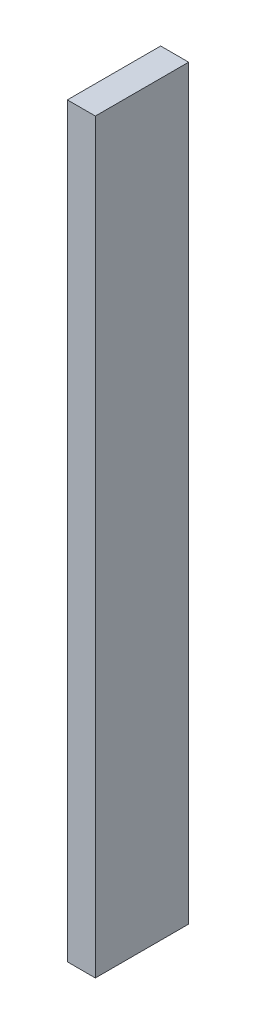
ISO-10303-21;
HEADER;
FILE_DESCRIPTION(('STEP AP214'),'2;1');
FILE_NAME('part.step','',(''),(''),'','','');
FILE_SCHEMA(('AUTOMOTIVE_DESIGN { 1 0 10303 214 1 1 1 1 }'));
ENDSEC;
DATA;
#1=APPLICATION_CONTEXT('core data for automotive mechanical design processes');
#2=APPLICATION_PROTOCOL_DEFINITION('international standard','automotive_design',2000,#1);
#3=PRODUCT_CONTEXT('',#1,'mechanical');
#4=PRODUCT('Part','Part','',(#3));
#5=PRODUCT_RELATED_PRODUCT_CATEGORY('part','',(#4));
#6=PRODUCT_DEFINITION_FORMATION('','',#4);
#7=PRODUCT_DEFINITION_CONTEXT('part definition',#1,'design');
#8=PRODUCT_DEFINITION('design','',#6,#7);
#9=PRODUCT_DEFINITION_SHAPE('','',#8);
#10=(LENGTH_UNIT() NAMED_UNIT(*) SI_UNIT(.MILLI.,.METRE.));
#11=(NAMED_UNIT(*) PLANE_ANGLE_UNIT() SI_UNIT($,.RADIAN.));
#12=(NAMED_UNIT(*) SI_UNIT($,.STERADIAN.) SOLID_ANGLE_UNIT());
#13=UNCERTAINTY_MEASURE_WITH_UNIT(LENGTH_MEASURE(1.E-05),#10,'distance_accuracy_value','');
#14=(GEOMETRIC_REPRESENTATION_CONTEXT(3) GLOBAL_UNCERTAINTY_ASSIGNED_CONTEXT((#13)) GLOBAL_UNIT_ASSIGNED_CONTEXT((#10,
#11,#12)) REPRESENTATION_CONTEXT('',''));
#15=CARTESIAN_POINT('',(0.,0.,0.));
#16=DIRECTION('',(0.,0.,1.));
#17=DIRECTION('',(1.,0.,0.));
#18=AXIS2_PLACEMENT_3D('',#15,#16,#17);
#19=CARTESIAN_POINT('',(1.5,80.,-5.));
#20=DIRECTION('',(-1.,0.,0.));
#21=DIRECTION('',(0.,0.,1.));
#22=AXIS2_PLACEMENT_3D('',#19,#20,#21);
#23=PLANE('',#22);
#24=DIRECTION('',(0.,0.,-1.));
#25=VECTOR('',#24,1.);
#26=CARTESIAN_POINT('',(1.5,0.,-5.));
#27=LINE('',#26,#25);
#28=CARTESIAN_POINT('',(1.5,0.,5.));
#29=VERTEX_POINT('',#28);
#30=CARTESIAN_POINT('',(1.5,0.,-5.));
#31=VERTEX_POINT('',#30);
#32=EDGE_CURVE('E96',#29,#31,#27,.T.);
#33=ORIENTED_EDGE('',*,*,#32,.T.);
#34=DIRECTION('',(0.,-1.,0.));
#35=VECTOR('',#34,1.);
#36=CARTESIAN_POINT('',(1.5,80.,-5.));
#37=LINE('',#36,#35);
#38=CARTESIAN_POINT('',(1.5,80.,-5.));
#39=VERTEX_POINT('',#38);
#40=EDGE_CURVE('E11',#39,#31,#37,.T.);
#41=ORIENTED_EDGE('',*,*,#40,.F.);
#42=DIRECTION('',(0.,0.,-1.));
#43=VECTOR('',#42,1.);
#44=CARTESIAN_POINT('',(1.5,80.,-5.));
#45=LINE('',#44,#43);
#46=CARTESIAN_POINT('',(1.5,80.,5.));
#47=VERTEX_POINT('',#46);
#48=EDGE_CURVE('E84',#47,#39,#45,.T.);
#49=ORIENTED_EDGE('',*,*,#48,.F.);
#50=DIRECTION('',(0.,-1.,0.));
#51=VECTOR('',#50,1.);
#52=CARTESIAN_POINT('',(1.5,80.,5.));
#53=LINE('',#52,#51);
#54=EDGE_CURVE('E92',#47,#29,#53,.T.);
#55=ORIENTED_EDGE('',*,*,#54,.T.);
#56=EDGE_LOOP('',(#33,#41,#49,#55));
#57=FACE_BOUND('',#56,.T.);
#58=ADVANCED_FACE('F33',(#57),#23,.F.);
#59=CARTESIAN_POINT('',(-1.5,80.,-5.));
#60=DIRECTION('',(0.,0.,1.));
#61=DIRECTION('',(1.,0.,0.));
#62=AXIS2_PLACEMENT_3D('',#59,#60,#61);
#63=PLANE('',#62);
#64=DIRECTION('',(-1.,0.,0.));
#65=VECTOR('',#64,1.);
#66=CARTESIAN_POINT('',(-1.5,0.,-5.));
#67=LINE('',#66,#65);
#68=CARTESIAN_POINT('',(-1.5,0.,-5.));
#69=VERTEX_POINT('',#68);
#70=EDGE_CURVE('E88',#31,#69,#67,.T.);
#71=ORIENTED_EDGE('',*,*,#70,.T.);
#72=DIRECTION('',(0.,-1.,0.));
#73=VECTOR('',#72,1.);
#74=CARTESIAN_POINT('',(-1.5,80.,-5.));
#75=LINE('',#74,#73);
#76=CARTESIAN_POINT('',(-1.5,80.,-5.));
#77=VERTEX_POINT('',#76);
#78=EDGE_CURVE('E41',#77,#69,#75,.T.);
#79=ORIENTED_EDGE('',*,*,#78,.F.);
#80=DIRECTION('',(-1.,0.,0.));
#81=VECTOR('',#80,1.);
#82=CARTESIAN_POINT('',(-1.5,80.,-5.));
#83=LINE('',#82,#81);
#84=EDGE_CURVE('E79',#39,#77,#83,.T.);
#85=ORIENTED_EDGE('',*,*,#84,.F.);
#86=ORIENTED_EDGE('',*,*,#40,.T.);
#87=EDGE_LOOP('',(#71,#79,#85,#86));
#88=FACE_BOUND('',#87,.T.);
#89=ADVANCED_FACE('F87',(#88),#63,.F.);
#90=CARTESIAN_POINT('',(-1.5,80.,-5.));
#91=DIRECTION('',(1.,0.,0.));
#92=DIRECTION('',(0.,0.,-1.));
#93=AXIS2_PLACEMENT_3D('',#90,#91,#92);
#94=PLANE('',#93);
#95=DIRECTION('',(0.,0.,1.));
#96=VECTOR('',#95,1.);
#97=CARTESIAN_POINT('',(-1.5,0.,-5.));
#98=LINE('',#97,#96);
#99=CARTESIAN_POINT('',(-1.5,0.,5.));
#100=VERTEX_POINT('',#99);
#101=EDGE_CURVE('E66',#69,#100,#98,.T.);
#102=ORIENTED_EDGE('',*,*,#101,.T.);
#103=DIRECTION('',(0.,-1.,0.));
#104=VECTOR('',#103,1.);
#105=CARTESIAN_POINT('',(-1.5,80.,5.));
#106=LINE('',#105,#104);
#107=CARTESIAN_POINT('',(-1.5,80.,5.));
#108=VERTEX_POINT('',#107);
#109=EDGE_CURVE('E89',#108,#100,#106,.T.);
#110=ORIENTED_EDGE('',*,*,#109,.F.);
#111=DIRECTION('',(0.,0.,1.));
#112=VECTOR('',#111,1.);
#113=CARTESIAN_POINT('',(-1.5,80.,-5.));
#114=LINE('',#113,#112);
#115=EDGE_CURVE('E82',#77,#108,#114,.T.);
#116=ORIENTED_EDGE('',*,*,#115,.F.);
#117=ORIENTED_EDGE('',*,*,#78,.T.);
#118=EDGE_LOOP('',(#102,#110,#116,#117));
#119=FACE_BOUND('',#118,.T.);
#120=ADVANCED_FACE('F90',(#119),#94,.F.);
#121=CARTESIAN_POINT('',(-1.5,80.,5.));
#122=DIRECTION('',(0.,0.,-1.));
#123=DIRECTION('',(-1.,0.,0.));
#124=AXIS2_PLACEMENT_3D('',#121,#122,#123);
#125=PLANE('',#124);
#126=DIRECTION('',(1.,0.,0.));
#127=VECTOR('',#126,1.);
#128=CARTESIAN_POINT('',(-1.5,0.,5.));
#129=LINE('',#128,#127);
#130=EDGE_CURVE('E72',#100,#29,#129,.T.);
#131=ORIENTED_EDGE('',*,*,#130,.T.);
#132=ORIENTED_EDGE('',*,*,#54,.F.);
#133=DIRECTION('',(1.,0.,0.));
#134=VECTOR('',#133,1.);
#135=CARTESIAN_POINT('',(-1.5,80.,5.));
#136=LINE('',#135,#134);
#137=EDGE_CURVE('E49',#108,#47,#136,.T.);
#138=ORIENTED_EDGE('',*,*,#137,.F.);
#139=ORIENTED_EDGE('',*,*,#109,.T.);
#140=EDGE_LOOP('',(#131,#132,#138,#139));
#141=FACE_BOUND('',#140,.T.);
#142=ADVANCED_FACE('F103',(#141),#125,.F.);
#143=CARTESIAN_POINT('',(0.,80.,0.));
#144=DIRECTION('',(0.,1.,0.));
#145=DIRECTION('',(0.,0.,1.));
#146=AXIS2_PLACEMENT_3D('',#143,#144,#145);
#147=PLANE('',#146);
#148=ORIENTED_EDGE('',*,*,#48,.T.);
#149=ORIENTED_EDGE('',*,*,#84,.T.);
#150=ORIENTED_EDGE('',*,*,#115,.T.);
#151=ORIENTED_EDGE('',*,*,#137,.T.);
#152=EDGE_LOOP('',(#148,#149,#150,#151));
#153=FACE_BOUND('',#152,.T.);
#154=ADVANCED_FACE('F80',(#153),#147,.T.);
#155=CARTESIAN_POINT('',(0.,0.,0.));
#156=DIRECTION('',(0.,1.,0.));
#157=DIRECTION('',(0.,0.,1.));
#158=AXIS2_PLACEMENT_3D('',#155,#156,#157);
#159=PLANE('',#158);
#160=ORIENTED_EDGE('',*,*,#32,.F.);
#161=ORIENTED_EDGE('',*,*,#130,.F.);
#162=ORIENTED_EDGE('',*,*,#101,.F.);
#163=ORIENTED_EDGE('',*,*,#70,.F.);
#164=EDGE_LOOP('',(#160,#161,#162,#163));
#165=FACE_BOUND('',#164,.T.);
#166=ADVANCED_FACE('F106',(#165),#159,.F.);
#167=CLOSED_SHELL('',(#58,#89,#120,#142,#154,#166));
#168=MANIFOLD_SOLID_BREP('B2',#167);
#169=ADVANCED_BREP_SHAPE_REPRESENTATION('',(#18,#168),#14);
#170=SHAPE_DEFINITION_REPRESENTATION(#9,#169);
ENDSEC;
END-ISO-10303-21;
